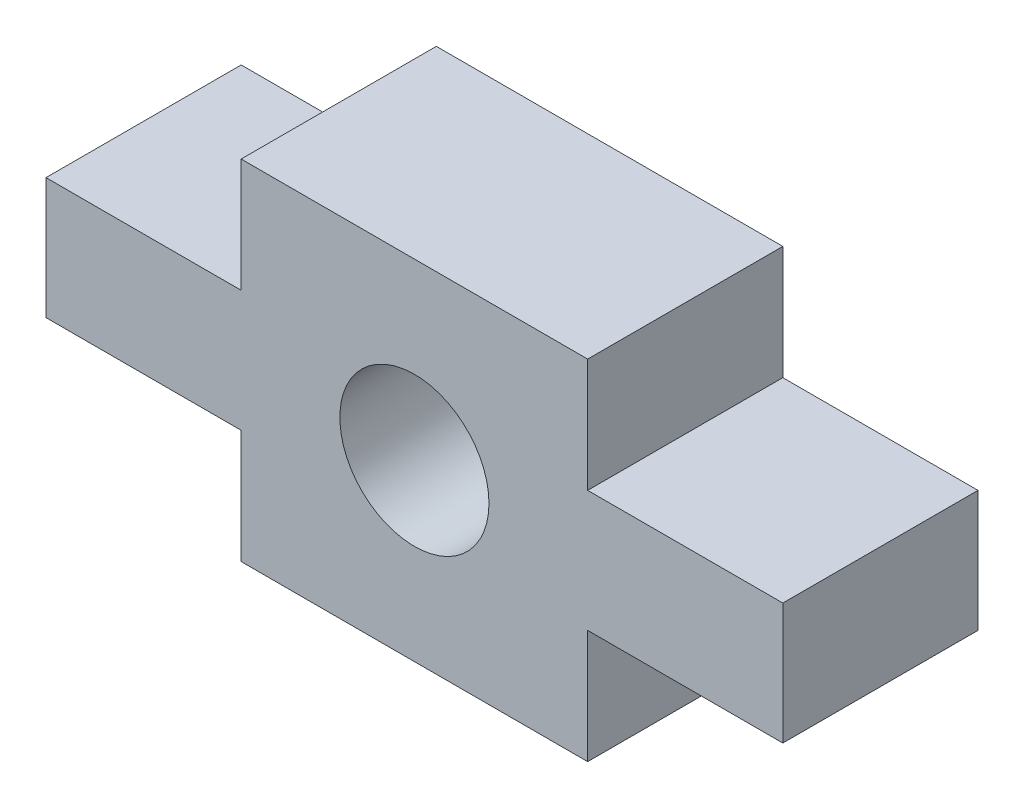
ISO-10303-21;
HEADER;
FILE_DESCRIPTION(('STEP AP214'),'2;1');
FILE_NAME('part.step','',(''),(''),'','','');
FILE_SCHEMA(('AUTOMOTIVE_DESIGN { 1 0 10303 214 1 1 1 1 }'));
ENDSEC;
DATA;
#1=APPLICATION_CONTEXT('core data for automotive mechanical design processes');
#2=APPLICATION_PROTOCOL_DEFINITION('international standard','automotive_design',2000,#1);
#3=PRODUCT_CONTEXT('',#1,'mechanical');
#4=PRODUCT('Part','Part','',(#3));
#5=PRODUCT_RELATED_PRODUCT_CATEGORY('part','',(#4));
#6=PRODUCT_DEFINITION_FORMATION('','',#4);
#7=PRODUCT_DEFINITION_CONTEXT('part definition',#1,'design');
#8=PRODUCT_DEFINITION('design','',#6,#7);
#9=PRODUCT_DEFINITION_SHAPE('','',#8);
#10=(LENGTH_UNIT() NAMED_UNIT(*) SI_UNIT(.MILLI.,.METRE.));
#11=(NAMED_UNIT(*) PLANE_ANGLE_UNIT() SI_UNIT($,.RADIAN.));
#12=(NAMED_UNIT(*) SI_UNIT($,.STERADIAN.) SOLID_ANGLE_UNIT());
#13=UNCERTAINTY_MEASURE_WITH_UNIT(LENGTH_MEASURE(1.E-05),#10,'distance_accuracy_value','');
#14=(GEOMETRIC_REPRESENTATION_CONTEXT(3) GLOBAL_UNCERTAINTY_ASSIGNED_CONTEXT((#13)) GLOBAL_UNIT_ASSIGNED_CONTEXT((#10,
#11,#12)) REPRESENTATION_CONTEXT('',''));
#15=CARTESIAN_POINT('',(0.,0.,0.));
#16=DIRECTION('',(0.,0.,1.));
#17=DIRECTION('',(1.,0.,0.));
#18=AXIS2_PLACEMENT_3D('',#15,#16,#17);
#19=CARTESIAN_POINT('',(5.05,6.1,5.15));
#20=DIRECTION('',(0.,-1.,0.));
#21=DIRECTION('',(0.,0.,-1.));
#22=AXIS2_PLACEMENT_3D('',#19,#20,#21);
#23=PLANE('',#22);
#24=DIRECTION('',(-1.,0.,0.));
#25=VECTOR('',#24,1.);
#26=CARTESIAN_POINT('',(5.05,6.1,0.));
#27=LINE('',#26,#25);
#28=CARTESIAN_POINT('',(5.05,6.1,0.));
#29=VERTEX_POINT('',#28);
#30=CARTESIAN_POINT('',(-0.1,6.1,0.));
#31=VERTEX_POINT('',#30);
#32=EDGE_CURVE('E200',#29,#31,#27,.T.);
#33=ORIENTED_EDGE('',*,*,#32,.T.);
#34=DIRECTION('',(0.,0.,-1.));
#35=VECTOR('',#34,1.);
#36=CARTESIAN_POINT('',(-0.1,6.1,5.15));
#37=LINE('',#36,#35);
#38=CARTESIAN_POINT('',(-0.1,6.1,5.15));
#39=VERTEX_POINT('',#38);
#40=EDGE_CURVE('E12',#39,#31,#37,.T.);
#41=ORIENTED_EDGE('',*,*,#40,.F.);
#42=DIRECTION('',(-1.,0.,0.));
#43=VECTOR('',#42,1.);
#44=CARTESIAN_POINT('',(5.05,6.1,5.15));
#45=LINE('',#44,#43);
#46=CARTESIAN_POINT('',(5.05,6.1,5.15));
#47=VERTEX_POINT('',#46);
#48=EDGE_CURVE('E192',#47,#39,#45,.T.);
#49=ORIENTED_EDGE('',*,*,#48,.F.);
#50=DIRECTION('',(0.,0.,-1.));
#51=VECTOR('',#50,1.);
#52=CARTESIAN_POINT('',(5.05,6.1,5.15));
#53=LINE('',#52,#51);
#54=EDGE_CURVE('E152',#47,#29,#53,.T.);
#55=ORIENTED_EDGE('',*,*,#54,.T.);
#56=EDGE_LOOP('',(#33,#41,#49,#55));
#57=FACE_BOUND('',#56,.T.);
#58=ADVANCED_FACE('F36',(#57),#23,.F.);
#59=CARTESIAN_POINT('',(-0.1,6.1,5.15));
#60=DIRECTION('',(1.,0.,0.));
#61=DIRECTION('',(0.,0.,-1.));
#62=AXIS2_PLACEMENT_3D('',#59,#60,#61);
#63=PLANE('',#62);
#64=DIRECTION('',(0.,-1.,0.));
#65=VECTOR('',#64,1.);
#66=CARTESIAN_POINT('',(-0.1,6.1,0.));
#67=LINE('',#66,#65);
#68=CARTESIAN_POINT('',(-0.1,2.9,0.));
#69=VERTEX_POINT('',#68);
#70=EDGE_CURVE('E204',#31,#69,#67,.T.);
#71=ORIENTED_EDGE('',*,*,#70,.T.);
#72=DIRECTION('',(0.,0.,-1.));
#73=VECTOR('',#72,1.);
#74=CARTESIAN_POINT('',(-0.1,2.9,5.15));
#75=LINE('',#74,#73);
#76=CARTESIAN_POINT('',(-0.1,2.9,5.15));
#77=VERTEX_POINT('',#76);
#78=EDGE_CURVE('E44',#77,#69,#75,.T.);
#79=ORIENTED_EDGE('',*,*,#78,.F.);
#80=DIRECTION('',(0.,-1.,0.));
#81=VECTOR('',#80,1.);
#82=CARTESIAN_POINT('',(-0.1,6.1,5.15));
#83=LINE('',#82,#81);
#84=EDGE_CURVE('E107',#39,#77,#83,.T.);
#85=ORIENTED_EDGE('',*,*,#84,.F.);
#86=ORIENTED_EDGE('',*,*,#40,.T.);
#87=EDGE_LOOP('',(#71,#79,#85,#86));
#88=FACE_BOUND('',#87,.T.);
#89=ADVANCED_FACE('F269',(#88),#63,.F.);
#90=CARTESIAN_POINT('',(-0.1,2.9,5.15));
#91=DIRECTION('',(0.,1.,0.));
#92=DIRECTION('',(0.,0.,1.));
#93=AXIS2_PLACEMENT_3D('',#90,#91,#92);
#94=PLANE('',#93);
#95=DIRECTION('',(1.,0.,0.));
#96=VECTOR('',#95,1.);
#97=CARTESIAN_POINT('',(-0.1,2.9,0.));
#98=LINE('',#97,#96);
#99=CARTESIAN_POINT('',(5.05,2.9,0.));
#100=VERTEX_POINT('',#99);
#101=EDGE_CURVE('E208',#69,#100,#98,.T.);
#102=ORIENTED_EDGE('',*,*,#101,.T.);
#103=DIRECTION('',(0.,0.,-1.));
#104=VECTOR('',#103,1.);
#105=CARTESIAN_POINT('',(5.05,2.9,5.15));
#106=LINE('',#105,#104);
#107=CARTESIAN_POINT('',(5.05,2.9,5.15));
#108=VERTEX_POINT('',#107);
#109=EDGE_CURVE('E245',#108,#100,#106,.T.);
#110=ORIENTED_EDGE('',*,*,#109,.F.);
#111=DIRECTION('',(1.,0.,0.));
#112=VECTOR('',#111,1.);
#113=CARTESIAN_POINT('',(-0.1,2.9,5.15));
#114=LINE('',#113,#112);
#115=EDGE_CURVE('E183',#77,#108,#114,.T.);
#116=ORIENTED_EDGE('',*,*,#115,.F.);
#117=ORIENTED_EDGE('',*,*,#78,.T.);
#118=EDGE_LOOP('',(#102,#110,#116,#117));
#119=FACE_BOUND('',#118,.T.);
#120=ADVANCED_FACE('F251',(#119),#94,.F.);
#121=CARTESIAN_POINT('',(5.05,2.9,5.15));
#122=DIRECTION('',(1.,0.,0.));
#123=DIRECTION('',(0.,0.,-1.));
#124=AXIS2_PLACEMENT_3D('',#121,#122,#123);
#125=PLANE('',#124);
#126=DIRECTION('',(0.,-1.,0.));
#127=VECTOR('',#126,1.);
#128=CARTESIAN_POINT('',(5.05,2.9,0.));
#129=LINE('',#128,#127);
#130=CARTESIAN_POINT('',(5.05,-0.1,0.));
#131=VERTEX_POINT('',#130);
#132=EDGE_CURVE('E212',#100,#131,#129,.T.);
#133=ORIENTED_EDGE('',*,*,#132,.T.);
#134=DIRECTION('',(0.,0.,-1.));
#135=VECTOR('',#134,1.);
#136=CARTESIAN_POINT('',(5.05,-0.1,5.15));
#137=LINE('',#136,#135);
#138=CARTESIAN_POINT('',(5.05,-0.1,5.15));
#139=VERTEX_POINT('',#138);
#140=EDGE_CURVE('E242',#139,#131,#137,.T.);
#141=ORIENTED_EDGE('',*,*,#140,.F.);
#142=DIRECTION('',(0.,-1.,0.));
#143=VECTOR('',#142,1.);
#144=CARTESIAN_POINT('',(5.05,2.9,5.15));
#145=LINE('',#144,#143);
#146=EDGE_CURVE('E180',#108,#139,#145,.T.);
#147=ORIENTED_EDGE('',*,*,#146,.F.);
#148=ORIENTED_EDGE('',*,*,#109,.T.);
#149=EDGE_LOOP('',(#133,#141,#147,#148));
#150=FACE_BOUND('',#149,.T.);
#151=ADVANCED_FACE('F260',(#150),#125,.F.);
#152=CARTESIAN_POINT('',(5.05,-0.1,5.15));
#153=DIRECTION('',(0.,1.,0.));
#154=DIRECTION('',(0.,0.,1.));
#155=AXIS2_PLACEMENT_3D('',#152,#153,#154);
#156=PLANE('',#155);
#157=DIRECTION('',(1.,0.,0.));
#158=VECTOR('',#157,1.);
#159=CARTESIAN_POINT('',(5.05,-0.1,0.));
#160=LINE('',#159,#158);
#161=CARTESIAN_POINT('',(14.193,-0.1,0.));
#162=VERTEX_POINT('',#161);
#163=EDGE_CURVE('E214',#131,#162,#160,.T.);
#164=ORIENTED_EDGE('',*,*,#163,.T.);
#165=DIRECTION('',(0.,0.,-1.));
#166=VECTOR('',#165,1.);
#167=CARTESIAN_POINT('',(14.193,-0.1,5.15));
#168=LINE('',#167,#166);
#169=CARTESIAN_POINT('',(14.193,-0.1,5.15));
#170=VERTEX_POINT('',#169);
#171=EDGE_CURVE('E239',#170,#162,#168,.T.);
#172=ORIENTED_EDGE('',*,*,#171,.F.);
#173=DIRECTION('',(1.,0.,0.));
#174=VECTOR('',#173,1.);
#175=CARTESIAN_POINT('',(5.05,-0.1,5.15));
#176=LINE('',#175,#174);
#177=EDGE_CURVE('E178',#139,#170,#176,.T.);
#178=ORIENTED_EDGE('',*,*,#177,.F.);
#179=ORIENTED_EDGE('',*,*,#140,.T.);
#180=EDGE_LOOP('',(#164,#172,#178,#179));
#181=FACE_BOUND('',#180,.T.);
#182=ADVANCED_FACE('F264',(#181),#156,.F.);
#183=CARTESIAN_POINT('',(14.193,-0.1,5.15));
#184=DIRECTION('',(-1.,0.,0.));
#185=DIRECTION('',(0.,0.,1.));
#186=AXIS2_PLACEMENT_3D('',#183,#184,#185);
#187=PLANE('',#186);
#188=DIRECTION('',(0.,1.,0.));
#189=VECTOR('',#188,1.);
#190=CARTESIAN_POINT('',(14.193,-0.1,0.));
#191=LINE('',#190,#189);
#192=CARTESIAN_POINT('',(14.193,2.9,0.));
#193=VERTEX_POINT('',#192);
#194=EDGE_CURVE('E216',#162,#193,#191,.T.);
#195=ORIENTED_EDGE('',*,*,#194,.T.);
#196=DIRECTION('',(0.,0.,-1.));
#197=VECTOR('',#196,1.);
#198=CARTESIAN_POINT('',(14.193,2.9,5.15));
#199=LINE('',#198,#197);
#200=CARTESIAN_POINT('',(14.193,2.9,5.15));
#201=VERTEX_POINT('',#200);
#202=EDGE_CURVE('E236',#201,#193,#199,.T.);
#203=ORIENTED_EDGE('',*,*,#202,.F.);
#204=DIRECTION('',(0.,1.,0.));
#205=VECTOR('',#204,1.);
#206=CARTESIAN_POINT('',(14.193,-0.1,5.15));
#207=LINE('',#206,#205);
#208=EDGE_CURVE('E170',#170,#201,#207,.T.);
#209=ORIENTED_EDGE('',*,*,#208,.F.);
#210=ORIENTED_EDGE('',*,*,#171,.T.);
#211=EDGE_LOOP('',(#195,#203,#209,#210));
#212=FACE_BOUND('',#211,.T.);
#213=ADVANCED_FACE('F281',(#212),#187,.F.);
#214=CARTESIAN_POINT('',(14.193,2.9,5.15));
#215=DIRECTION('',(0.,1.,0.));
#216=DIRECTION('',(0.,0.,1.));
#217=AXIS2_PLACEMENT_3D('',#214,#215,#216);
#218=PLANE('',#217);
#219=DIRECTION('',(1.,0.,0.));
#220=VECTOR('',#219,1.);
#221=CARTESIAN_POINT('',(14.193,2.9,0.));
#222=LINE('',#221,#220);
#223=CARTESIAN_POINT('',(19.343,2.9,0.));
#224=VERTEX_POINT('',#223);
#225=EDGE_CURVE('E218',#193,#224,#222,.T.);
#226=ORIENTED_EDGE('',*,*,#225,.T.);
#227=DIRECTION('',(0.,0.,-1.));
#228=VECTOR('',#227,1.);
#229=CARTESIAN_POINT('',(19.343,2.9,5.15));
#230=LINE('',#229,#228);
#231=CARTESIAN_POINT('',(19.343,2.9,5.15));
#232=VERTEX_POINT('',#231);
#233=EDGE_CURVE('E233',#232,#224,#230,.T.);
#234=ORIENTED_EDGE('',*,*,#233,.F.);
#235=DIRECTION('',(1.,0.,0.));
#236=VECTOR('',#235,1.);
#237=CARTESIAN_POINT('',(14.193,2.9,5.15));
#238=LINE('',#237,#236);
#239=EDGE_CURVE('E167',#201,#232,#238,.T.);
#240=ORIENTED_EDGE('',*,*,#239,.F.);
#241=ORIENTED_EDGE('',*,*,#202,.T.);
#242=EDGE_LOOP('',(#226,#234,#240,#241));
#243=FACE_BOUND('',#242,.T.);
#244=ADVANCED_FACE('F284',(#243),#218,.F.);
#245=CARTESIAN_POINT('',(19.343,2.9,5.15));
#246=DIRECTION('',(-1.,0.,0.));
#247=DIRECTION('',(0.,0.,1.));
#248=AXIS2_PLACEMENT_3D('',#245,#246,#247);
#249=PLANE('',#248);
#250=DIRECTION('',(0.,1.,0.));
#251=VECTOR('',#250,1.);
#252=CARTESIAN_POINT('',(19.343,2.9,0.));
#253=LINE('',#252,#251);
#254=CARTESIAN_POINT('',(19.343,6.1,0.));
#255=VERTEX_POINT('',#254);
#256=EDGE_CURVE('E220',#224,#255,#253,.T.);
#257=ORIENTED_EDGE('',*,*,#256,.T.);
#258=DIRECTION('',(0.,0.,-1.));
#259=VECTOR('',#258,1.);
#260=CARTESIAN_POINT('',(19.343,6.1,5.15));
#261=LINE('',#260,#259);
#262=CARTESIAN_POINT('',(19.343,6.1,5.15));
#263=VERTEX_POINT('',#262);
#264=EDGE_CURVE('E230',#263,#255,#261,.T.);
#265=ORIENTED_EDGE('',*,*,#264,.F.);
#266=DIRECTION('',(0.,1.,0.));
#267=VECTOR('',#266,1.);
#268=CARTESIAN_POINT('',(19.343,2.9,5.15));
#269=LINE('',#268,#267);
#270=EDGE_CURVE('E164',#232,#263,#269,.T.);
#271=ORIENTED_EDGE('',*,*,#270,.F.);
#272=ORIENTED_EDGE('',*,*,#233,.T.);
#273=EDGE_LOOP('',(#257,#265,#271,#272));
#274=FACE_BOUND('',#273,.T.);
#275=ADVANCED_FACE('F288',(#274),#249,.F.);
#276=CARTESIAN_POINT('',(19.343,6.1,5.15));
#277=DIRECTION('',(0.,-1.,0.));
#278=DIRECTION('',(0.,0.,-1.));
#279=AXIS2_PLACEMENT_3D('',#276,#277,#278);
#280=PLANE('',#279);
#281=DIRECTION('',(-1.,0.,0.));
#282=VECTOR('',#281,1.);
#283=CARTESIAN_POINT('',(19.343,6.1,0.));
#284=LINE('',#283,#282);
#285=CARTESIAN_POINT('',(14.193,6.1,0.));
#286=VERTEX_POINT('',#285);
#287=EDGE_CURVE('E222',#255,#286,#284,.T.);
#288=ORIENTED_EDGE('',*,*,#287,.T.);
#289=DIRECTION('',(0.,0.,-1.));
#290=VECTOR('',#289,1.);
#291=CARTESIAN_POINT('',(14.193,6.1,5.15));
#292=LINE('',#291,#290);
#293=CARTESIAN_POINT('',(14.193,6.1,5.15));
#294=VERTEX_POINT('',#293);
#295=EDGE_CURVE('E147',#294,#286,#292,.T.);
#296=ORIENTED_EDGE('',*,*,#295,.F.);
#297=DIRECTION('',(-1.,0.,0.));
#298=VECTOR('',#297,1.);
#299=CARTESIAN_POINT('',(19.343,6.1,5.15));
#300=LINE('',#299,#298);
#301=EDGE_CURVE('E138',#263,#294,#300,.T.);
#302=ORIENTED_EDGE('',*,*,#301,.F.);
#303=ORIENTED_EDGE('',*,*,#264,.T.);
#304=EDGE_LOOP('',(#288,#296,#302,#303));
#305=FACE_BOUND('',#304,.T.);
#306=ADVANCED_FACE('F292',(#305),#280,.F.);
#307=CARTESIAN_POINT('',(14.193,6.1,5.15));
#308=DIRECTION('',(-1.,0.,0.));
#309=DIRECTION('',(0.,0.,1.));
#310=AXIS2_PLACEMENT_3D('',#307,#308,#309);
#311=PLANE('',#310);
#312=DIRECTION('',(0.,1.,0.));
#313=VECTOR('',#312,1.);
#314=CARTESIAN_POINT('',(14.193,6.1,0.));
#315=LINE('',#314,#313);
#316=CARTESIAN_POINT('',(14.193,9.1,0.));
#317=VERTEX_POINT('',#316);
#318=EDGE_CURVE('E146',#286,#317,#315,.T.);
#319=ORIENTED_EDGE('',*,*,#318,.T.);
#320=DIRECTION('',(0.,0.,-1.));
#321=VECTOR('',#320,1.);
#322=CARTESIAN_POINT('',(14.193,9.1,5.15));
#323=LINE('',#322,#321);
#324=CARTESIAN_POINT('',(14.193,9.1,5.15));
#325=VERTEX_POINT('',#324);
#326=EDGE_CURVE('E143',#325,#317,#323,.T.);
#327=ORIENTED_EDGE('',*,*,#326,.F.);
#328=DIRECTION('',(0.,1.,0.));
#329=VECTOR('',#328,1.);
#330=CARTESIAN_POINT('',(14.193,6.1,5.15));
#331=LINE('',#330,#329);
#332=EDGE_CURVE('E132',#294,#325,#331,.T.);
#333=ORIENTED_EDGE('',*,*,#332,.F.);
#334=ORIENTED_EDGE('',*,*,#295,.T.);
#335=EDGE_LOOP('',(#319,#327,#333,#334));
#336=FACE_BOUND('',#335,.T.);
#337=ADVANCED_FACE('F144',(#336),#311,.F.);
#338=CARTESIAN_POINT('',(14.193,9.1,5.15));
#339=DIRECTION('',(0.,-1.,0.));
#340=DIRECTION('',(0.,0.,-1.));
#341=AXIS2_PLACEMENT_3D('',#338,#339,#340);
#342=PLANE('',#341);
#343=DIRECTION('',(-1.,0.,0.));
#344=VECTOR('',#343,1.);
#345=CARTESIAN_POINT('',(14.193,9.1,0.));
#346=LINE('',#345,#344);
#347=CARTESIAN_POINT('',(5.05,9.1,0.));
#348=VERTEX_POINT('',#347);
#349=EDGE_CURVE('E93',#317,#348,#346,.T.);
#350=ORIENTED_EDGE('',*,*,#349,.T.);
#351=DIRECTION('',(0.,0.,-1.));
#352=VECTOR('',#351,1.);
#353=CARTESIAN_POINT('',(5.05,9.1,5.15));
#354=LINE('',#353,#352);
#355=CARTESIAN_POINT('',(5.05,9.1,5.15));
#356=VERTEX_POINT('',#355);
#357=EDGE_CURVE('E148',#356,#348,#354,.T.);
#358=ORIENTED_EDGE('',*,*,#357,.F.);
#359=DIRECTION('',(-1.,0.,0.));
#360=VECTOR('',#359,1.);
#361=CARTESIAN_POINT('',(14.193,9.1,5.15));
#362=LINE('',#361,#360);
#363=EDGE_CURVE('E136',#325,#356,#362,.T.);
#364=ORIENTED_EDGE('',*,*,#363,.F.);
#365=ORIENTED_EDGE('',*,*,#326,.T.);
#366=EDGE_LOOP('',(#350,#358,#364,#365));
#367=FACE_BOUND('',#366,.T.);
#368=ADVANCED_FACE('F150',(#367),#342,.F.);
#369=CARTESIAN_POINT('',(5.05,9.1,5.15));
#370=DIRECTION('',(1.,0.,0.));
#371=DIRECTION('',(0.,0.,-1.));
#372=AXIS2_PLACEMENT_3D('',#369,#370,#371);
#373=PLANE('',#372);
#374=DIRECTION('',(0.,-1.,0.));
#375=VECTOR('',#374,1.);
#376=CARTESIAN_POINT('',(5.05,9.1,0.));
#377=LINE('',#376,#375);
#378=EDGE_CURVE('E99',#348,#29,#377,.T.);
#379=ORIENTED_EDGE('',*,*,#378,.T.);
#380=ORIENTED_EDGE('',*,*,#54,.F.);
#381=DIRECTION('',(0.,-1.,0.));
#382=VECTOR('',#381,1.);
#383=CARTESIAN_POINT('',(5.05,9.1,5.15));
#384=LINE('',#383,#382);
#385=EDGE_CURVE('E52',#356,#47,#384,.T.);
#386=ORIENTED_EDGE('',*,*,#385,.F.);
#387=ORIENTED_EDGE('',*,*,#357,.T.);
#388=EDGE_LOOP('',(#379,#380,#386,#387));
#389=FACE_BOUND('',#388,.T.);
#390=ADVANCED_FACE('F301',(#389),#373,.F.);
#391=CARTESIAN_POINT('',(-0.1,6.1,5.15));
#392=DIRECTION('',(0.,0.,1.));
#393=DIRECTION('',(1.,0.,0.));
#394=AXIS2_PLACEMENT_3D('',#391,#392,#393);
#395=PLANE('',#394);
#396=CARTESIAN_POINT('',(9.6215,4.5,5.15));
#397=DIRECTION('',(0.,0.,1.));
#398=DIRECTION('',(1.,0.,0.));
#399=AXIS2_PLACEMENT_3D('',#396,#397,#398);
#400=CIRCLE('',#399,1.9675);
#401=CARTESIAN_POINT('',(11.589,4.5,5.15));
#402=VERTEX_POINT('',#401);
#403=EDGE_CURVE('E194',#402,#402,#400,.T.);
#404=ORIENTED_EDGE('',*,*,#403,.F.);
#405=EDGE_LOOP('',(#404));
#406=FACE_BOUND('',#405,.T.);
#407=ORIENTED_EDGE('',*,*,#48,.T.);
#408=ORIENTED_EDGE('',*,*,#84,.T.);
#409=ORIENTED_EDGE('',*,*,#115,.T.);
#410=ORIENTED_EDGE('',*,*,#146,.T.);
#411=ORIENTED_EDGE('',*,*,#177,.T.);
#412=ORIENTED_EDGE('',*,*,#208,.T.);
#413=ORIENTED_EDGE('',*,*,#239,.T.);
#414=ORIENTED_EDGE('',*,*,#270,.T.);
#415=ORIENTED_EDGE('',*,*,#301,.T.);
#416=ORIENTED_EDGE('',*,*,#332,.T.);
#417=ORIENTED_EDGE('',*,*,#363,.T.);
#418=ORIENTED_EDGE('',*,*,#385,.T.);
#419=EDGE_LOOP('',(#407,#408,#409,#410,#411,#412,#413,#414,#415,#416,#417,#418));
#420=FACE_BOUND('',#419,.T.);
#421=ADVANCED_FACE('F134',(#406,#420),#395,.T.);
#422=CARTESIAN_POINT('',(-0.1,6.1,0.));
#423=DIRECTION('',(0.,0.,1.));
#424=DIRECTION('',(1.,0.,0.));
#425=AXIS2_PLACEMENT_3D('',#422,#423,#424);
#426=PLANE('',#425);
#427=CARTESIAN_POINT('',(9.6215,4.5,0.));
#428=DIRECTION('',(0.,0.,1.));
#429=DIRECTION('',(1.,0.,0.));
#430=AXIS2_PLACEMENT_3D('',#427,#428,#429);
#431=CIRCLE('',#430,1.9675);
#432=CARTESIAN_POINT('',(11.589,4.5,0.));
#433=VERTEX_POINT('',#432);
#434=EDGE_CURVE('E198',#433,#433,#431,.T.);
#435=ORIENTED_EDGE('',*,*,#434,.T.);
#436=EDGE_LOOP('',(#435));
#437=FACE_BOUND('',#436,.T.);
#438=ORIENTED_EDGE('',*,*,#32,.F.);
#439=ORIENTED_EDGE('',*,*,#378,.F.);
#440=ORIENTED_EDGE('',*,*,#349,.F.);
#441=ORIENTED_EDGE('',*,*,#318,.F.);
#442=ORIENTED_EDGE('',*,*,#287,.F.);
#443=ORIENTED_EDGE('',*,*,#256,.F.);
#444=ORIENTED_EDGE('',*,*,#225,.F.);
#445=ORIENTED_EDGE('',*,*,#194,.F.);
#446=ORIENTED_EDGE('',*,*,#163,.F.);
#447=ORIENTED_EDGE('',*,*,#132,.F.);
#448=ORIENTED_EDGE('',*,*,#101,.F.);
#449=ORIENTED_EDGE('',*,*,#70,.F.);
#450=EDGE_LOOP('',(#438,#439,#440,#441,#442,#443,#444,#445,#446,#447,#448,#449));
#451=FACE_BOUND('',#450,.T.);
#452=ADVANCED_FACE('F255',(#437,#451),#426,.F.);
#453=CARTESIAN_POINT('',(9.6215,4.5,0.));
#454=DIRECTION('',(0.,0.,1.));
#455=DIRECTION('',(1.,0.,0.));
#456=AXIS2_PLACEMENT_3D('',#453,#454,#455);
#457=CYLINDRICAL_SURFACE('',#456,1.9675);
#458=ORIENTED_EDGE('',*,*,#434,.F.);
#459=EDGE_LOOP('',(#458));
#460=FACE_BOUND('',#459,.T.);
#461=ORIENTED_EDGE('',*,*,#403,.T.);
#462=EDGE_LOOP('',(#461));
#463=FACE_BOUND('',#462,.T.);
#464=ADVANCED_FACE('F306',(#460,#463),#457,.F.);
#465=CLOSED_SHELL('',(#58,#89,#120,#151,#182,#213,#244,#275,#306,#337,#368,#390,#421,#452,#464));
#466=MANIFOLD_SOLID_BREP('B2',#465);
#467=ADVANCED_BREP_SHAPE_REPRESENTATION('',(#18,#466),#14);
#468=SHAPE_DEFINITION_REPRESENTATION(#9,#467);
ENDSEC;
END-ISO-10303-21;
